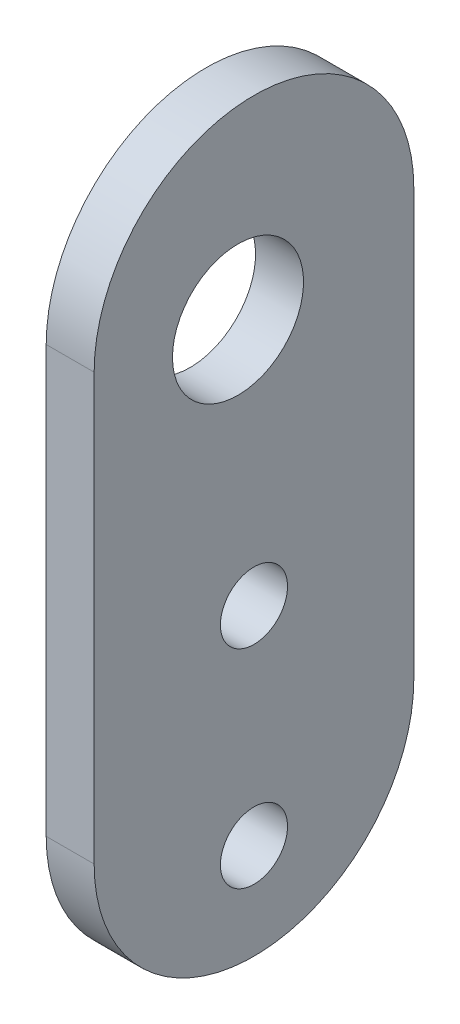
ISO-10303-21;
HEADER;
FILE_DESCRIPTION(('STEP AP214'),'2;1');
FILE_NAME('part.step','',(''),(''),'','','');
FILE_SCHEMA(('AUTOMOTIVE_DESIGN { 1 0 10303 214 1 1 1 1 }'));
ENDSEC;
DATA;
#1=APPLICATION_CONTEXT('core data for automotive mechanical design processes');
#2=APPLICATION_PROTOCOL_DEFINITION('international standard','automotive_design',2000,#1);
#3=PRODUCT_CONTEXT('',#1,'mechanical');
#4=PRODUCT('Part','Part','',(#3));
#5=PRODUCT_RELATED_PRODUCT_CATEGORY('part','',(#4));
#6=PRODUCT_DEFINITION_FORMATION('','',#4);
#7=PRODUCT_DEFINITION_CONTEXT('part definition',#1,'design');
#8=PRODUCT_DEFINITION('design','',#6,#7);
#9=PRODUCT_DEFINITION_SHAPE('','',#8);
#10=(LENGTH_UNIT() NAMED_UNIT(*) SI_UNIT(.MILLI.,.METRE.));
#11=(NAMED_UNIT(*) PLANE_ANGLE_UNIT() SI_UNIT($,.RADIAN.));
#12=(NAMED_UNIT(*) SI_UNIT($,.STERADIAN.) SOLID_ANGLE_UNIT());
#13=UNCERTAINTY_MEASURE_WITH_UNIT(LENGTH_MEASURE(1.E-05),#10,'distance_accuracy_value','');
#14=(GEOMETRIC_REPRESENTATION_CONTEXT(3) GLOBAL_UNCERTAINTY_ASSIGNED_CONTEXT((#13)) GLOBAL_UNIT_ASSIGNED_CONTEXT((#10,
#11,#12)) REPRESENTATION_CONTEXT('',''));
#15=CARTESIAN_POINT('',(0.,0.,0.));
#16=DIRECTION('',(0.,0.,1.));
#17=DIRECTION('',(1.,0.,0.));
#18=AXIS2_PLACEMENT_3D('',#15,#16,#17);
#19=CARTESIAN_POINT('',(-126.55,168.0857476665,139.));
#20=DIRECTION('',(1.,0.,0.));
#21=DIRECTION('',(0.,0.,-1.));
#22=AXIS2_PLACEMENT_3D('',#19,#20,#21);
#23=PLANE('',#22);
#24=CARTESIAN_POINT('',(-126.55,119.0857476665,138.));
#25=DIRECTION('',(-1.,0.,0.));
#26=DIRECTION('',(0.,0.,1.));
#27=AXIS2_PLACEMENT_3D('',#24,#25,#26);
#28=CIRCLE('',#27,2.09999999999999);
#29=CARTESIAN_POINT('',(-126.55,119.0857476665,140.1));
#30=VERTEX_POINT('',#29);
#31=EDGE_CURVE('E93',#30,#30,#28,.F.);
#32=ORIENTED_EDGE('',*,*,#31,.T.);
#33=EDGE_LOOP('',(#32));
#34=FACE_BOUND('',#33,.T.);
#35=CARTESIAN_POINT('',(-126.55,132.0857476665,138.));
#36=DIRECTION('',(-1.,0.,0.));
#37=DIRECTION('',(0.,0.,1.));
#38=AXIS2_PLACEMENT_3D('',#35,#36,#37);
#39=CIRCLE('',#38,2.09999999999999);
#40=CARTESIAN_POINT('',(-126.55,132.0857476665,140.1));
#41=VERTEX_POINT('',#40);
#42=EDGE_CURVE('E96',#41,#41,#39,.F.);
#43=ORIENTED_EDGE('',*,*,#42,.T.);
#44=EDGE_LOOP('',(#43));
#45=FACE_BOUND('',#44,.T.);
#46=CARTESIAN_POINT('',(-126.55,148.0857476665,139.));
#47=DIRECTION('',(-1.,0.,0.));
#48=DIRECTION('',(0.,0.,1.));
#49=AXIS2_PLACEMENT_3D('',#46,#47,#48);
#50=CIRCLE('',#49,4.09999999999999);
#51=CARTESIAN_POINT('',(-126.55,148.0857476665,143.1));
#52=VERTEX_POINT('',#51);
#53=EDGE_CURVE('E69',#52,#52,#50,.F.);
#54=ORIENTED_EDGE('',*,*,#53,.T.);
#55=EDGE_LOOP('',(#54));
#56=FACE_BOUND('',#55,.T.);
#57=DIRECTION('',(0.,1.,0.));
#58=VECTOR('',#57,1.);
#59=CARTESIAN_POINT('',(-126.55,195.9043807818,128.));
#60=LINE('',#59,#58);
#61=CARTESIAN_POINT('',(-126.55,149.7357476665,128.));
#62=VERTEX_POINT('',#61);
#63=CARTESIAN_POINT('',(-126.55,123.0857476665,128.));
#64=VERTEX_POINT('',#63);
#65=EDGE_CURVE('E57',#62,#64,#60,.F.);
#66=ORIENTED_EDGE('',*,*,#65,.T.);
#67=CARTESIAN_POINT('',(-126.55,123.0857476665,138.));
#68=DIRECTION('',(1.,0.,0.));
#69=DIRECTION('',(0.,0.,-1.));
#70=AXIS2_PLACEMENT_3D('',#67,#68,#69);
#71=CIRCLE('',#70,10.);
#72=CARTESIAN_POINT('',(-126.55,123.0857476665,148.));
#73=VERTEX_POINT('',#72);
#74=EDGE_CURVE('E76',#73,#64,#71,.T.);
#75=ORIENTED_EDGE('',*,*,#74,.F.);
#76=DIRECTION('',(0.,1.,0.));
#77=VECTOR('',#76,1.);
#78=CARTESIAN_POINT('',(-126.55,107.4054732291,148.));
#79=LINE('',#78,#77);
#80=CARTESIAN_POINT('',(-126.55,149.7357476665,148.));
#81=VERTEX_POINT('',#80);
#82=EDGE_CURVE('E59',#73,#81,#79,.T.);
#83=ORIENTED_EDGE('',*,*,#82,.T.);
#84=CARTESIAN_POINT('',(-126.55,149.7357476665,138.));
#85=DIRECTION('',(-1.,0.,0.));
#86=DIRECTION('',(0.,0.,1.));
#87=AXIS2_PLACEMENT_3D('',#84,#85,#86);
#88=CIRCLE('',#87,10.);
#89=EDGE_CURVE('E19',#62,#81,#88,.F.);
#90=ORIENTED_EDGE('',*,*,#89,.F.);
#91=EDGE_LOOP('',(#66,#75,#83,#90));
#92=FACE_BOUND('',#91,.T.);
#93=ADVANCED_FACE('F16',(#34,#45,#56,#92),#23,.F.);
#94=CARTESIAN_POINT('',(-117.032,149.7357476665,138.));
#95=DIRECTION('',(-1.,0.,0.));
#96=DIRECTION('',(0.,0.,1.));
#97=AXIS2_PLACEMENT_3D('',#94,#95,#96);
#98=CYLINDRICAL_SURFACE('',#97,10.);
#99=ORIENTED_EDGE('',*,*,#89,.T.);
#100=DIRECTION('',(-1.,0.,0.));
#101=VECTOR('',#100,1.);
#102=CARTESIAN_POINT('',(-123.55,149.7357476665,148.));
#103=LINE('',#102,#101);
#104=CARTESIAN_POINT('',(-123.55,149.7357476665,148.));
#105=VERTEX_POINT('',#104);
#106=EDGE_CURVE('E80',#81,#105,#103,.F.);
#107=ORIENTED_EDGE('',*,*,#106,.T.);
#108=CARTESIAN_POINT('',(-123.55,149.7357476665,138.));
#109=DIRECTION('',(-1.,0.,0.));
#110=DIRECTION('',(0.,0.,1.));
#111=AXIS2_PLACEMENT_3D('',#108,#109,#110);
#112=CIRCLE('',#111,10.);
#113=CARTESIAN_POINT('',(-123.55,149.7357476665,128.));
#114=VERTEX_POINT('',#113);
#115=EDGE_CURVE('E66',#114,#105,#112,.F.);
#116=ORIENTED_EDGE('',*,*,#115,.F.);
#117=DIRECTION('',(1.,0.,0.));
#118=VECTOR('',#117,1.);
#119=CARTESIAN_POINT('',(-123.55,149.7357476665,128.));
#120=LINE('',#119,#118);
#121=EDGE_CURVE('E63',#114,#62,#120,.F.);
#122=ORIENTED_EDGE('',*,*,#121,.T.);
#123=EDGE_LOOP('',(#99,#107,#116,#122));
#124=FACE_BOUND('',#123,.T.);
#125=ADVANCED_FACE('F64',(#124),#98,.T.);
#126=CARTESIAN_POINT('',(-123.55,107.4054732291,148.));
#127=DIRECTION('',(0.,0.,-1.));
#128=DIRECTION('',(-1.,0.,0.));
#129=AXIS2_PLACEMENT_3D('',#126,#127,#128);
#130=PLANE('',#129);
#131=ORIENTED_EDGE('',*,*,#82,.F.);
#132=DIRECTION('',(1.,0.,0.));
#133=VECTOR('',#132,1.);
#134=CARTESIAN_POINT('',(-135.068,123.0857476665,148.));
#135=LINE('',#134,#133);
#136=CARTESIAN_POINT('',(-123.55,123.0857476665,148.));
#137=VERTEX_POINT('',#136);
#138=EDGE_CURVE('E72',#137,#73,#135,.F.);
#139=ORIENTED_EDGE('',*,*,#138,.F.);
#140=DIRECTION('',(0.,1.,0.));
#141=VECTOR('',#140,1.);
#142=CARTESIAN_POINT('',(-123.55,168.0857476665,148.));
#143=LINE('',#142,#141);
#144=EDGE_CURVE('E91',#105,#137,#143,.F.);
#145=ORIENTED_EDGE('',*,*,#144,.F.);
#146=ORIENTED_EDGE('',*,*,#106,.F.);
#147=EDGE_LOOP('',(#131,#139,#145,#146));
#148=FACE_BOUND('',#147,.T.);
#149=ADVANCED_FACE('F103',(#148),#130,.F.);
#150=CARTESIAN_POINT('',(-135.068,123.0857476665,138.));
#151=DIRECTION('',(1.,0.,0.));
#152=DIRECTION('',(0.,0.,-1.));
#153=AXIS2_PLACEMENT_3D('',#150,#151,#152);
#154=CYLINDRICAL_SURFACE('',#153,10.);
#155=CARTESIAN_POINT('',(-123.55,123.0857476665,138.));
#156=DIRECTION('',(1.,0.,0.));
#157=DIRECTION('',(0.,0.,-1.));
#158=AXIS2_PLACEMENT_3D('',#155,#156,#157);
#159=CIRCLE('',#158,10.);
#160=CARTESIAN_POINT('',(-123.55,123.0857476665,128.));
#161=VERTEX_POINT('',#160);
#162=EDGE_CURVE('E88',#137,#161,#159,.T.);
#163=ORIENTED_EDGE('',*,*,#162,.F.);
#164=ORIENTED_EDGE('',*,*,#138,.T.);
#165=ORIENTED_EDGE('',*,*,#74,.T.);
#166=DIRECTION('',(1.,0.,0.));
#167=VECTOR('',#166,1.);
#168=CARTESIAN_POINT('',(-123.55,123.0857476665,128.));
#169=LINE('',#168,#167);
#170=EDGE_CURVE('E34',#64,#161,#169,.T.);
#171=ORIENTED_EDGE('',*,*,#170,.T.);
#172=EDGE_LOOP('',(#163,#164,#165,#171));
#173=FACE_BOUND('',#172,.T.);
#174=ADVANCED_FACE('F108',(#173),#154,.T.);
#175=CARTESIAN_POINT('',(-123.55,195.9043807818,128.));
#176=DIRECTION('',(0.,0.,1.));
#177=DIRECTION('',(1.,0.,0.));
#178=AXIS2_PLACEMENT_3D('',#175,#176,#177);
#179=PLANE('',#178);
#180=DIRECTION('',(0.,1.,0.));
#181=VECTOR('',#180,1.);
#182=CARTESIAN_POINT('',(-123.55,168.0857476665,128.));
#183=LINE('',#182,#181);
#184=EDGE_CURVE('E87',#161,#114,#183,.T.);
#185=ORIENTED_EDGE('',*,*,#184,.F.);
#186=ORIENTED_EDGE('',*,*,#170,.F.);
#187=ORIENTED_EDGE('',*,*,#65,.F.);
#188=ORIENTED_EDGE('',*,*,#121,.F.);
#189=EDGE_LOOP('',(#185,#186,#187,#188));
#190=FACE_BOUND('',#189,.T.);
#191=ADVANCED_FACE('F71',(#190),#179,.F.);
#192=CARTESIAN_POINT('',(-128.55,148.0857476665,139.));
#193=DIRECTION('',(-1.,0.,0.));
#194=DIRECTION('',(0.,0.,1.));
#195=AXIS2_PLACEMENT_3D('',#192,#193,#194);
#196=CYLINDRICAL_SURFACE('',#195,4.09999999999999);
#197=CARTESIAN_POINT('',(-123.55,148.0857476665,139.));
#198=DIRECTION('',(-1.,0.,0.));
#199=DIRECTION('',(0.,0.,1.));
#200=AXIS2_PLACEMENT_3D('',#197,#198,#199);
#201=CIRCLE('',#200,4.09999999999999);
#202=CARTESIAN_POINT('',(-123.55,148.0857476665,143.1));
#203=VERTEX_POINT('',#202);
#204=EDGE_CURVE('E84',#203,#203,#201,.T.);
#205=ORIENTED_EDGE('',*,*,#204,.F.);
#206=EDGE_LOOP('',(#205));
#207=FACE_BOUND('',#206,.T.);
#208=ORIENTED_EDGE('',*,*,#53,.F.);
#209=EDGE_LOOP('',(#208));
#210=FACE_BOUND('',#209,.T.);
#211=ADVANCED_FACE('F116',(#207,#210),#196,.F.);
#212=CARTESIAN_POINT('',(-128.55,132.0857476665,138.));
#213=DIRECTION('',(-1.,0.,0.));
#214=DIRECTION('',(0.,0.,1.));
#215=AXIS2_PLACEMENT_3D('',#212,#213,#214);
#216=CYLINDRICAL_SURFACE('',#215,2.09999999999999);
#217=CARTESIAN_POINT('',(-123.55,132.0857476665,138.));
#218=DIRECTION('',(-1.,0.,0.));
#219=DIRECTION('',(0.,0.,1.));
#220=AXIS2_PLACEMENT_3D('',#217,#218,#219);
#221=CIRCLE('',#220,2.09999999999999);
#222=CARTESIAN_POINT('',(-123.55,132.0857476665,140.1));
#223=VERTEX_POINT('',#222);
#224=EDGE_CURVE('E25',#223,#223,#221,.T.);
#225=ORIENTED_EDGE('',*,*,#224,.F.);
#226=EDGE_LOOP('',(#225));
#227=FACE_BOUND('',#226,.T.);
#228=ORIENTED_EDGE('',*,*,#42,.F.);
#229=EDGE_LOOP('',(#228));
#230=FACE_BOUND('',#229,.T.);
#231=ADVANCED_FACE('F126',(#227,#230),#216,.F.);
#232=CARTESIAN_POINT('',(-128.55,119.0857476665,138.));
#233=DIRECTION('',(-1.,0.,0.));
#234=DIRECTION('',(0.,0.,1.));
#235=AXIS2_PLACEMENT_3D('',#232,#233,#234);
#236=CYLINDRICAL_SURFACE('',#235,2.09999999999999);
#237=CARTESIAN_POINT('',(-123.55,119.0857476665,138.));
#238=DIRECTION('',(-1.,0.,0.));
#239=DIRECTION('',(0.,0.,1.));
#240=AXIS2_PLACEMENT_3D('',#237,#238,#239);
#241=CIRCLE('',#240,2.09999999999999);
#242=CARTESIAN_POINT('',(-123.55,119.0857476665,140.1));
#243=VERTEX_POINT('',#242);
#244=EDGE_CURVE('E11',#243,#243,#241,.T.);
#245=ORIENTED_EDGE('',*,*,#244,.F.);
#246=EDGE_LOOP('',(#245));
#247=FACE_BOUND('',#246,.T.);
#248=ORIENTED_EDGE('',*,*,#31,.F.);
#249=EDGE_LOOP('',(#248));
#250=FACE_BOUND('',#249,.T.);
#251=ADVANCED_FACE('F120',(#247,#250),#236,.F.);
#252=CARTESIAN_POINT('',(-123.55,168.0857476665,139.));
#253=DIRECTION('',(1.,0.,0.));
#254=DIRECTION('',(0.,0.,-1.));
#255=AXIS2_PLACEMENT_3D('',#252,#253,#254);
#256=PLANE('',#255);
#257=ORIENTED_EDGE('',*,*,#244,.T.);
#258=EDGE_LOOP('',(#257));
#259=FACE_BOUND('',#258,.T.);
#260=ORIENTED_EDGE('',*,*,#224,.T.);
#261=EDGE_LOOP('',(#260));
#262=FACE_BOUND('',#261,.T.);
#263=ORIENTED_EDGE('',*,*,#204,.T.);
#264=EDGE_LOOP('',(#263));
#265=FACE_BOUND('',#264,.T.);
#266=ORIENTED_EDGE('',*,*,#162,.T.);
#267=ORIENTED_EDGE('',*,*,#184,.T.);
#268=ORIENTED_EDGE('',*,*,#115,.T.);
#269=ORIENTED_EDGE('',*,*,#144,.T.);
#270=EDGE_LOOP('',(#266,#267,#268,#269));
#271=FACE_BOUND('',#270,.T.);
#272=ADVANCED_FACE('F106',(#259,#262,#265,#271),#256,.T.);
#273=CLOSED_SHELL('',(#93,#125,#149,#174,#191,#211,#231,#251,#272));
#274=MANIFOLD_SOLID_BREP('B1',#273);
#275=ADVANCED_BREP_SHAPE_REPRESENTATION('',(#18,#274),#14);
#276=SHAPE_DEFINITION_REPRESENTATION(#9,#275);
ENDSEC;
END-ISO-10303-21;
